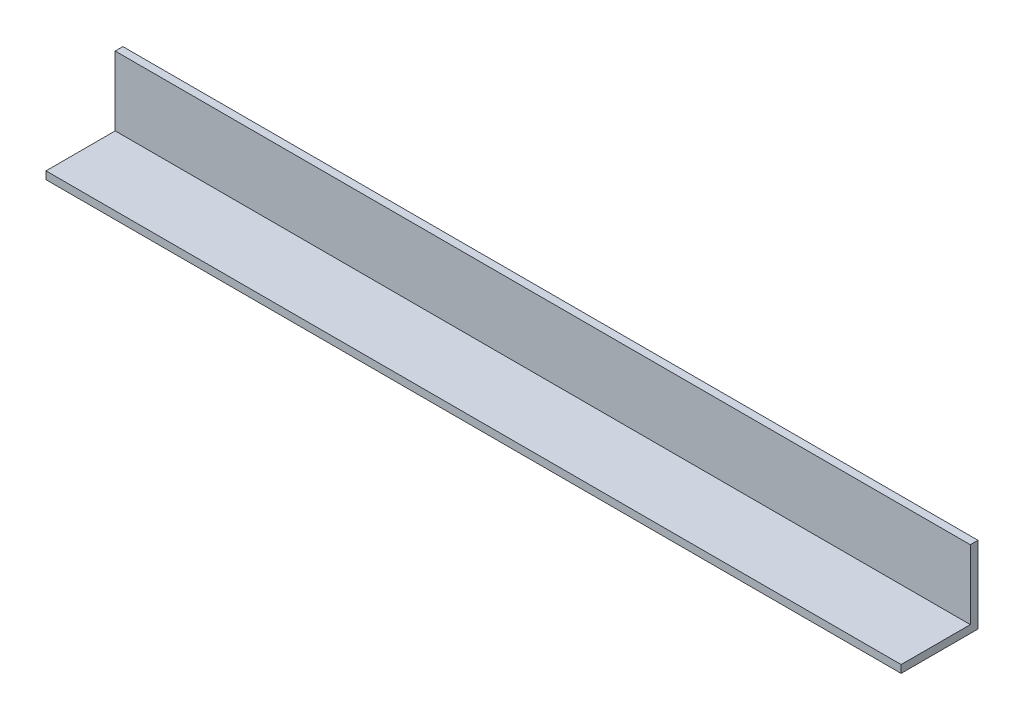
ISO-10303-21;
HEADER;
FILE_DESCRIPTION(('STEP AP214'),'2;1');
FILE_NAME('part.step','',(''),(''),'','','');
FILE_SCHEMA(('AUTOMOTIVE_DESIGN { 1 0 10303 214 1 1 1 1 }'));
ENDSEC;
DATA;
#1=APPLICATION_CONTEXT('core data for automotive mechanical design processes');
#2=APPLICATION_PROTOCOL_DEFINITION('international standard','automotive_design',2000,#1);
#3=PRODUCT_CONTEXT('',#1,'mechanical');
#4=PRODUCT('Part','Part','',(#3));
#5=PRODUCT_RELATED_PRODUCT_CATEGORY('part','',(#4));
#6=PRODUCT_DEFINITION_FORMATION('','',#4);
#7=PRODUCT_DEFINITION_CONTEXT('part definition',#1,'design');
#8=PRODUCT_DEFINITION('design','',#6,#7);
#9=PRODUCT_DEFINITION_SHAPE('','',#8);
#10=(LENGTH_UNIT() NAMED_UNIT(*) SI_UNIT(.MILLI.,.METRE.));
#11=(NAMED_UNIT(*) PLANE_ANGLE_UNIT() SI_UNIT($,.RADIAN.));
#12=(NAMED_UNIT(*) SI_UNIT($,.STERADIAN.) SOLID_ANGLE_UNIT());
#13=UNCERTAINTY_MEASURE_WITH_UNIT(LENGTH_MEASURE(1.E-05),#10,'distance_accuracy_value','');
#14=(GEOMETRIC_REPRESENTATION_CONTEXT(3) GLOBAL_UNCERTAINTY_ASSIGNED_CONTEXT((#13)) GLOBAL_UNIT_ASSIGNED_CONTEXT((#10,
#11,#12)) REPRESENTATION_CONTEXT('',''));
#15=CARTESIAN_POINT('',(0.,0.,0.));
#16=DIRECTION('',(0.,0.,1.));
#17=DIRECTION('',(1.,0.,0.));
#18=AXIS2_PLACEMENT_3D('',#15,#16,#17);
#19=CARTESIAN_POINT('',(222.5,4.,-20.));
#20=DIRECTION('',(-1.,0.,0.));
#21=DIRECTION('',(0.,0.,1.));
#22=AXIS2_PLACEMENT_3D('',#19,#20,#21);
#23=PLANE('',#22);
#24=DIRECTION('',(0.,0.,-1.));
#25=VECTOR('',#24,1.);
#26=CARTESIAN_POINT('',(222.5,0.,-20.));
#27=LINE('',#26,#25);
#28=CARTESIAN_POINT('',(222.5,0.,20.));
#29=VERTEX_POINT('',#28);
#30=CARTESIAN_POINT('',(222.5,0.,-20.));
#31=VERTEX_POINT('',#30);
#32=EDGE_CURVE('E90',#29,#31,#27,.T.);
#33=ORIENTED_EDGE('',*,*,#32,.T.);
#34=DIRECTION('',(0.,-1.,0.));
#35=VECTOR('',#34,1.);
#36=CARTESIAN_POINT('',(222.5,4.,-20.));
#37=LINE('',#36,#35);
#38=CARTESIAN_POINT('',(222.5,40.,-20.));
#39=VERTEX_POINT('',#38);
#40=EDGE_CURVE('E11',#39,#31,#37,.T.);
#41=ORIENTED_EDGE('',*,*,#40,.F.);
#42=DIRECTION('',(0.,0.,-1.));
#43=VECTOR('',#42,1.);
#44=CARTESIAN_POINT('',(222.5,40.,-20.));
#45=LINE('',#44,#43);
#46=CARTESIAN_POINT('',(222.5,40.,-16.));
#47=VERTEX_POINT('',#46);
#48=EDGE_CURVE('E126',#47,#39,#45,.T.);
#49=ORIENTED_EDGE('',*,*,#48,.F.);
#50=DIRECTION('',(0.,-1.,0.));
#51=VECTOR('',#50,1.);
#52=CARTESIAN_POINT('',(222.5,40.,-16.));
#53=LINE('',#52,#51);
#54=CARTESIAN_POINT('',(222.5,4.,-16.));
#55=VERTEX_POINT('',#54);
#56=EDGE_CURVE('E99',#47,#55,#53,.T.);
#57=ORIENTED_EDGE('',*,*,#56,.T.);
#58=DIRECTION('',(0.,0.,-1.));
#59=VECTOR('',#58,1.);
#60=CARTESIAN_POINT('',(222.5,4.,-20.));
#61=LINE('',#60,#59);
#62=CARTESIAN_POINT('',(222.5,4.,20.));
#63=VERTEX_POINT('',#62);
#64=EDGE_CURVE('E84',#63,#55,#61,.T.);
#65=ORIENTED_EDGE('',*,*,#64,.F.);
#66=DIRECTION('',(0.,-1.,0.));
#67=VECTOR('',#66,1.);
#68=CARTESIAN_POINT('',(222.5,4.,20.));
#69=LINE('',#68,#67);
#70=EDGE_CURVE('E77',#63,#29,#69,.T.);
#71=ORIENTED_EDGE('',*,*,#70,.T.);
#72=EDGE_LOOP('',(#33,#41,#49,#57,#65,#71));
#73=FACE_BOUND('',#72,.T.);
#74=ADVANCED_FACE('F33',(#73),#23,.F.);
#75=CARTESIAN_POINT('',(-222.5,4.,-20.));
#76=DIRECTION('',(0.,0.,1.));
#77=DIRECTION('',(1.,0.,0.));
#78=AXIS2_PLACEMENT_3D('',#75,#76,#77);
#79=PLANE('',#78);
#80=DIRECTION('',(-1.,0.,0.));
#81=VECTOR('',#80,1.);
#82=CARTESIAN_POINT('',(-222.5,0.,-20.));
#83=LINE('',#82,#81);
#84=CARTESIAN_POINT('',(-222.5,0.,-20.));
#85=VERTEX_POINT('',#84);
#86=EDGE_CURVE('E94',#31,#85,#83,.T.);
#87=ORIENTED_EDGE('',*,*,#86,.T.);
#88=DIRECTION('',(0.,-1.,0.));
#89=VECTOR('',#88,1.);
#90=CARTESIAN_POINT('',(-222.5,4.,-20.));
#91=LINE('',#90,#89);
#92=CARTESIAN_POINT('',(-222.5,40.,-20.));
#93=VERTEX_POINT('',#92);
#94=EDGE_CURVE('E41',#93,#85,#91,.T.);
#95=ORIENTED_EDGE('',*,*,#94,.F.);
#96=DIRECTION('',(-1.,0.,0.));
#97=VECTOR('',#96,1.);
#98=CARTESIAN_POINT('',(-222.5,40.,-20.));
#99=LINE('',#98,#97);
#100=EDGE_CURVE('E116',#39,#93,#99,.T.);
#101=ORIENTED_EDGE('',*,*,#100,.F.);
#102=ORIENTED_EDGE('',*,*,#40,.T.);
#103=EDGE_LOOP('',(#87,#95,#101,#102));
#104=FACE_BOUND('',#103,.T.);
#105=ADVANCED_FACE('F150',(#104),#79,.F.);
#106=CARTESIAN_POINT('',(-222.5,4.,-20.));
#107=DIRECTION('',(1.,0.,0.));
#108=DIRECTION('',(0.,0.,-1.));
#109=AXIS2_PLACEMENT_3D('',#106,#107,#108);
#110=PLANE('',#109);
#111=DIRECTION('',(0.,0.,1.));
#112=VECTOR('',#111,1.);
#113=CARTESIAN_POINT('',(-222.5,0.,-20.));
#114=LINE('',#113,#112);
#115=CARTESIAN_POINT('',(-222.5,0.,20.));
#116=VERTEX_POINT('',#115);
#117=EDGE_CURVE('E85',#85,#116,#114,.T.);
#118=ORIENTED_EDGE('',*,*,#117,.T.);
#119=DIRECTION('',(0.,-1.,0.));
#120=VECTOR('',#119,1.);
#121=CARTESIAN_POINT('',(-222.5,4.,20.));
#122=LINE('',#121,#120);
#123=CARTESIAN_POINT('',(-222.5,4.,20.));
#124=VERTEX_POINT('',#123);
#125=EDGE_CURVE('E80',#124,#116,#122,.T.);
#126=ORIENTED_EDGE('',*,*,#125,.F.);
#127=DIRECTION('',(0.,0.,1.));
#128=VECTOR('',#127,1.);
#129=CARTESIAN_POINT('',(-222.5,4.,-20.));
#130=LINE('',#129,#128);
#131=CARTESIAN_POINT('',(-222.5,4.,-16.));
#132=VERTEX_POINT('',#131);
#133=EDGE_CURVE('E109',#132,#124,#130,.T.);
#134=ORIENTED_EDGE('',*,*,#133,.F.);
#135=DIRECTION('',(0.,-1.,0.));
#136=VECTOR('',#135,1.);
#137=CARTESIAN_POINT('',(-222.5,40.,-16.));
#138=LINE('',#137,#136);
#139=CARTESIAN_POINT('',(-222.5,40.,-16.));
#140=VERTEX_POINT('',#139);
#141=EDGE_CURVE('E95',#140,#132,#138,.T.);
#142=ORIENTED_EDGE('',*,*,#141,.F.);
#143=DIRECTION('',(0.,0.,1.));
#144=VECTOR('',#143,1.);
#145=CARTESIAN_POINT('',(-222.5,40.,-20.));
#146=LINE('',#145,#144);
#147=EDGE_CURVE('E119',#93,#140,#146,.T.);
#148=ORIENTED_EDGE('',*,*,#147,.F.);
#149=ORIENTED_EDGE('',*,*,#94,.T.);
#150=EDGE_LOOP('',(#118,#126,#134,#142,#148,#149));
#151=FACE_BOUND('',#150,.T.);
#152=ADVANCED_FACE('F144',(#151),#110,.F.);
#153=CARTESIAN_POINT('',(-222.5,4.,20.));
#154=DIRECTION('',(0.,0.,-1.));
#155=DIRECTION('',(-1.,0.,0.));
#156=AXIS2_PLACEMENT_3D('',#153,#154,#155);
#157=PLANE('',#156);
#158=DIRECTION('',(1.,0.,0.));
#159=VECTOR('',#158,1.);
#160=CARTESIAN_POINT('',(-222.5,0.,20.));
#161=LINE('',#160,#159);
#162=EDGE_CURVE('E74',#116,#29,#161,.T.);
#163=ORIENTED_EDGE('',*,*,#162,.T.);
#164=ORIENTED_EDGE('',*,*,#70,.F.);
#165=DIRECTION('',(1.,0.,0.));
#166=VECTOR('',#165,1.);
#167=CARTESIAN_POINT('',(-222.5,4.,20.));
#168=LINE('',#167,#166);
#169=EDGE_CURVE('E55',#124,#63,#168,.T.);
#170=ORIENTED_EDGE('',*,*,#169,.F.);
#171=ORIENTED_EDGE('',*,*,#125,.T.);
#172=EDGE_LOOP('',(#163,#164,#170,#171));
#173=FACE_BOUND('',#172,.T.);
#174=ADVANCED_FACE('F76',(#173),#157,.F.);
#175=CARTESIAN_POINT('',(0.,4.,0.));
#176=DIRECTION('',(0.,1.,0.));
#177=DIRECTION('',(0.,0.,1.));
#178=AXIS2_PLACEMENT_3D('',#175,#176,#177);
#179=PLANE('',#178);
#180=DIRECTION('',(1.,0.,0.));
#181=VECTOR('',#180,1.);
#182=CARTESIAN_POINT('',(222.5,4.,-16.));
#183=LINE('',#182,#181);
#184=EDGE_CURVE('E49',#132,#55,#183,.T.);
#185=ORIENTED_EDGE('',*,*,#184,.F.);
#186=ORIENTED_EDGE('',*,*,#133,.T.);
#187=ORIENTED_EDGE('',*,*,#169,.T.);
#188=ORIENTED_EDGE('',*,*,#64,.T.);
#189=EDGE_LOOP('',(#185,#186,#187,#188));
#190=FACE_BOUND('',#189,.T.);
#191=ADVANCED_FACE('F153',(#190),#179,.T.);
#192=CARTESIAN_POINT('',(0.,0.,0.));
#193=DIRECTION('',(0.,1.,0.));
#194=DIRECTION('',(0.,0.,1.));
#195=AXIS2_PLACEMENT_3D('',#192,#193,#194);
#196=PLANE('',#195);
#197=ORIENTED_EDGE('',*,*,#32,.F.);
#198=ORIENTED_EDGE('',*,*,#162,.F.);
#199=ORIENTED_EDGE('',*,*,#117,.F.);
#200=ORIENTED_EDGE('',*,*,#86,.F.);
#201=EDGE_LOOP('',(#197,#198,#199,#200));
#202=FACE_BOUND('',#201,.T.);
#203=ADVANCED_FACE('F93',(#202),#196,.F.);
#204=CARTESIAN_POINT('',(222.5,40.,-16.));
#205=DIRECTION('',(0.,0.,-1.));
#206=DIRECTION('',(-1.,0.,0.));
#207=AXIS2_PLACEMENT_3D('',#204,#205,#206);
#208=PLANE('',#207);
#209=ORIENTED_EDGE('',*,*,#184,.T.);
#210=ORIENTED_EDGE('',*,*,#56,.F.);
#211=DIRECTION('',(1.,0.,0.));
#212=VECTOR('',#211,1.);
#213=CARTESIAN_POINT('',(222.5,40.,-16.));
#214=LINE('',#213,#212);
#215=EDGE_CURVE('E132',#140,#47,#214,.T.);
#216=ORIENTED_EDGE('',*,*,#215,.F.);
#217=ORIENTED_EDGE('',*,*,#141,.T.);
#218=EDGE_LOOP('',(#209,#210,#216,#217));
#219=FACE_BOUND('',#218,.T.);
#220=ADVANCED_FACE('F146',(#219),#208,.F.);
#221=CARTESIAN_POINT('',(0.,40.,0.));
#222=DIRECTION('',(0.,-1.,0.));
#223=DIRECTION('',(0.,0.,-1.));
#224=AXIS2_PLACEMENT_3D('',#221,#222,#223);
#225=PLANE('',#224);
#226=ORIENTED_EDGE('',*,*,#147,.T.);
#227=ORIENTED_EDGE('',*,*,#215,.T.);
#228=ORIENTED_EDGE('',*,*,#48,.T.);
#229=ORIENTED_EDGE('',*,*,#100,.T.);
#230=EDGE_LOOP('',(#226,#227,#228,#229));
#231=FACE_BOUND('',#230,.T.);
#232=ADVANCED_FACE('F139',(#231),#225,.F.);
#233=CLOSED_SHELL('',(#74,#105,#152,#174,#191,#203,#220,#232));
#234=MANIFOLD_SOLID_BREP('B2',#233);
#235=ADVANCED_BREP_SHAPE_REPRESENTATION('',(#18,#234),#14);
#236=SHAPE_DEFINITION_REPRESENTATION(#9,#235);
ENDSEC;
END-ISO-10303-21;
